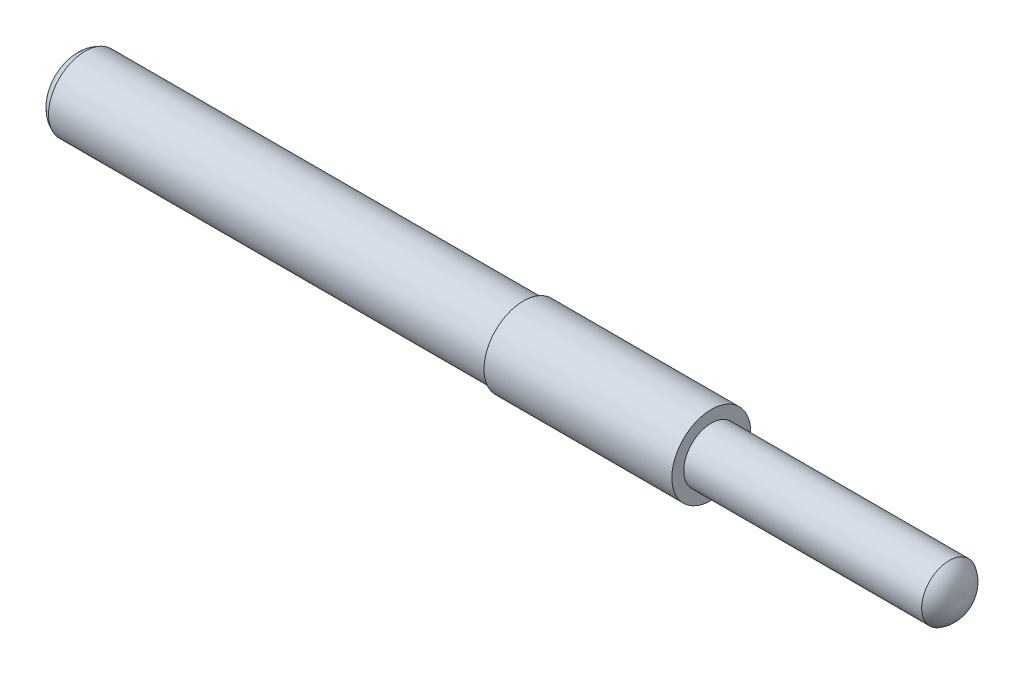
ISO-10303-21;
HEADER;
FILE_DESCRIPTION(('STEP AP214'),'2;1');
FILE_NAME('part.step','',(''),(''),'','','');
FILE_SCHEMA(('AUTOMOTIVE_DESIGN { 1 0 10303 214 1 1 1 1 }'));
ENDSEC;
DATA;
#1=APPLICATION_CONTEXT('core data for automotive mechanical design processes');
#2=APPLICATION_PROTOCOL_DEFINITION('international standard','automotive_design',2000,#1);
#3=PRODUCT_CONTEXT('',#1,'mechanical');
#4=PRODUCT('Part','Part','',(#3));
#5=PRODUCT_RELATED_PRODUCT_CATEGORY('part','',(#4));
#6=PRODUCT_DEFINITION_FORMATION('','',#4);
#7=PRODUCT_DEFINITION_CONTEXT('part definition',#1,'design');
#8=PRODUCT_DEFINITION('design','',#6,#7);
#9=PRODUCT_DEFINITION_SHAPE('','',#8);
#10=(LENGTH_UNIT() NAMED_UNIT(*) SI_UNIT(.MILLI.,.METRE.));
#11=(NAMED_UNIT(*) PLANE_ANGLE_UNIT() SI_UNIT($,.RADIAN.));
#12=(NAMED_UNIT(*) SI_UNIT($,.STERADIAN.) SOLID_ANGLE_UNIT());
#13=UNCERTAINTY_MEASURE_WITH_UNIT(LENGTH_MEASURE(1.E-05),#10,'distance_accuracy_value','');
#14=(GEOMETRIC_REPRESENTATION_CONTEXT(3) GLOBAL_UNCERTAINTY_ASSIGNED_CONTEXT((#13)) GLOBAL_UNIT_ASSIGNED_CONTEXT((#10,
#11,#12)) REPRESENTATION_CONTEXT('',''));
#15=CARTESIAN_POINT('',(0.,0.,0.));
#16=DIRECTION('',(0.,0.,1.));
#17=DIRECTION('',(1.,0.,0.));
#18=AXIS2_PLACEMENT_3D('',#15,#16,#17);
#19=CARTESIAN_POINT('',(-50.,0.,0.));
#20=DIRECTION('',(-1.,0.,0.));
#21=DIRECTION('',(0.,-1.,0.));
#22=AXIS2_PLACEMENT_3D('',#19,#20,#21);
#23=CYLINDRICAL_SURFACE('',#22,2.20000000000002);
#24=CARTESIAN_POINT('',(49.,0.,0.));
#25=DIRECTION('',(-1.,0.,0.));
#26=DIRECTION('',(0.,-1.,0.));
#27=AXIS2_PLACEMENT_3D('',#24,#25,#26);
#28=CIRCLE('',#27,2.20000000000002);
#29=CARTESIAN_POINT('',(49.,-2.2,0.));
#30=VERTEX_POINT('',#29);
#31=EDGE_CURVE('E11',#30,#30,#28,.T.);
#32=ORIENTED_EDGE('',*,*,#31,.T.);
#33=EDGE_LOOP('',(#32));
#34=FACE_BOUND('',#33,.T.);
#35=CARTESIAN_POINT('',(30.,0.,0.));
#36=DIRECTION('',(-1.,0.,0.));
#37=DIRECTION('',(0.,-1.,0.));
#38=AXIS2_PLACEMENT_3D('',#35,#36,#37);
#39=CIRCLE('',#38,2.20000000000002);
#40=CARTESIAN_POINT('',(30.,-2.2,0.));
#41=VERTEX_POINT('',#40);
#42=EDGE_CURVE('E71',#41,#41,#39,.T.);
#43=ORIENTED_EDGE('',*,*,#42,.F.);
#44=EDGE_LOOP('',(#43));
#45=FACE_BOUND('',#44,.T.);
#46=ADVANCED_FACE('F47',(#34,#45),#23,.T.);
#47=CARTESIAN_POINT('',(47.9718277716209,-0.405376259827689,0.));
#48=DIRECTION('',(0.,0.,-1.));
#49=DIRECTION('',(0.,-1.,0.));
#50=AXIS2_PLACEMENT_3D('',#47,#48,#49);
#51=CIRCLE('',#50,2.06828733497066);
#52=TRIMMED_CURVE('',#51,(PARAMETER_VALUE(-1.76806948002857)),
(PARAMETER_VALUE(1.76806948002857)),.T.,.PARAMETER.);
#53=CARTESIAN_POINT('',(47.9718277716209,0.,0.));
#54=DIRECTION('',(-1.,0.,0.));
#55=AXIS1_PLACEMENT('',#53,#54);
#56=SURFACE_OF_REVOLUTION('',#52,#55);
#57=CARTESIAN_POINT('',(50.,0.,0.));
#58=VERTEX_POINT('',#57);
#59=VERTEX_LOOP('',#58);
#60=FACE_BOUND('',#59,.T.);
#61=ORIENTED_EDGE('',*,*,#31,.F.);
#62=EDGE_LOOP('',(#61));
#63=FACE_BOUND('',#62,.T.);
#64=ADVANCED_FACE('F61',(#60,#63),#56,.T.);
#65=CARTESIAN_POINT('',(-19.4698172484888,-1.4625,0.));
#66=DIRECTION('',(0.,0.,-1.));
#67=DIRECTION('',(0.,-1.,0.));
#68=AXIS2_PLACEMENT_3D('',#65,#66,#67);
#69=CIRCLE('',#68,1.55563491861041);
#70=TRIMMED_CURVE('',#69,(PARAMETER_VALUE(-2.79380964974717)),
(PARAMETER_VALUE(2.79380964974717)),.T.,.PARAMETER.);
#71=CARTESIAN_POINT('',(-19.4698172484888,0.,0.));
#72=DIRECTION('',(-1.,0.,0.));
#73=AXIS1_PLACEMENT('',#71,#72);
#74=SURFACE_OF_REVOLUTION('',#70,#73);
#75=CARTESIAN_POINT('',(-20.,0.,0.));
#76=VERTEX_POINT('',#75);
#77=VERTEX_LOOP('',#76);
#78=FACE_BOUND('',#77,.T.);
#79=CARTESIAN_POINT('',(-20.,0.,0.));
#80=DIRECTION('',(-1.,0.,0.));
#81=DIRECTION('',(0.,-1.,0.));
#82=AXIS2_PLACEMENT_3D('',#79,#80,#81);
#83=CIRCLE('',#82,2.92500000000001);
#84=CARTESIAN_POINT('',(-20.,-2.925,0.));
#85=VERTEX_POINT('',#84);
#86=EDGE_CURVE('E55',#85,#85,#83,.T.);
#87=ORIENTED_EDGE('',*,*,#86,.T.);
#88=EDGE_LOOP('',(#87));
#89=FACE_BOUND('',#88,.T.);
#90=ADVANCED_FACE('F64',(#78,#89),#74,.T.);
#91=CARTESIAN_POINT('',(-50.,0.,0.));
#92=DIRECTION('',(-1.,0.,0.));
#93=DIRECTION('',(0.,-1.,0.));
#94=AXIS2_PLACEMENT_3D('',#91,#92,#93);
#95=CYLINDRICAL_SURFACE('',#94,2.92500000000001);
#96=ORIENTED_EDGE('',*,*,#86,.F.);
#97=EDGE_LOOP('',(#96));
#98=FACE_BOUND('',#97,.T.);
#99=CARTESIAN_POINT('',(15.,0.,0.));
#100=DIRECTION('',(-1.,0.,0.));
#101=DIRECTION('',(0.,-1.,0.));
#102=AXIS2_PLACEMENT_3D('',#99,#100,#101);
#103=CIRCLE('',#102,2.92500000000001);
#104=CARTESIAN_POINT('',(15.,-2.925,0.));
#105=VERTEX_POINT('',#104);
#106=EDGE_CURVE('E84',#105,#105,#103,.T.);
#107=ORIENTED_EDGE('',*,*,#106,.T.);
#108=EDGE_LOOP('',(#107));
#109=FACE_BOUND('',#108,.T.);
#110=ADVANCED_FACE('F92',(#98,#109),#95,.T.);
#111=CARTESIAN_POINT('',(15.,0.,0.));
#112=DIRECTION('',(1.,0.,0.));
#113=DIRECTION('',(0.,1.,0.));
#114=AXIS2_PLACEMENT_3D('',#111,#112,#113);
#115=PLANE('',#114);
#116=ORIENTED_EDGE('',*,*,#106,.F.);
#117=EDGE_LOOP('',(#116));
#118=FACE_BOUND('',#117,.T.);
#119=CARTESIAN_POINT('',(15.,0.,0.));
#120=DIRECTION('',(-1.,0.,0.));
#121=DIRECTION('',(0.,-1.,0.));
#122=AXIS2_PLACEMENT_3D('',#119,#120,#121);
#123=CIRCLE('',#122,3.15000000000001);
#124=CARTESIAN_POINT('',(15.,-3.15,0.));
#125=VERTEX_POINT('',#124);
#126=EDGE_CURVE('E78',#125,#125,#123,.T.);
#127=ORIENTED_EDGE('',*,*,#126,.T.);
#128=EDGE_LOOP('',(#127));
#129=FACE_BOUND('',#128,.T.);
#130=ADVANCED_FACE('F95',(#118,#129),#115,.F.);
#131=CARTESIAN_POINT('',(-50.,0.,0.));
#132=DIRECTION('',(-1.,0.,0.));
#133=DIRECTION('',(0.,-1.,0.));
#134=AXIS2_PLACEMENT_3D('',#131,#132,#133);
#135=CYLINDRICAL_SURFACE('',#134,3.15000000000001);
#136=ORIENTED_EDGE('',*,*,#126,.F.);
#137=EDGE_LOOP('',(#136));
#138=FACE_BOUND('',#137,.T.);
#139=CARTESIAN_POINT('',(30.,0.,0.));
#140=DIRECTION('',(-1.,0.,0.));
#141=DIRECTION('',(0.,-1.,0.));
#142=AXIS2_PLACEMENT_3D('',#139,#140,#141);
#143=CIRCLE('',#142,3.15000000000001);
#144=CARTESIAN_POINT('',(30.,-3.15,0.));
#145=VERTEX_POINT('',#144);
#146=EDGE_CURVE('E74',#145,#145,#143,.T.);
#147=ORIENTED_EDGE('',*,*,#146,.T.);
#148=EDGE_LOOP('',(#147));
#149=FACE_BOUND('',#148,.T.);
#150=ADVANCED_FACE('F101',(#138,#149),#135,.T.);
#151=CARTESIAN_POINT('',(30.,0.,0.));
#152=DIRECTION('',(-1.,0.,0.));
#153=DIRECTION('',(0.,-1.,0.));
#154=AXIS2_PLACEMENT_3D('',#151,#152,#153);
#155=PLANE('',#154);
#156=ORIENTED_EDGE('',*,*,#146,.F.);
#157=EDGE_LOOP('',(#156));
#158=FACE_BOUND('',#157,.T.);
#159=ORIENTED_EDGE('',*,*,#42,.T.);
#160=EDGE_LOOP('',(#159));
#161=FACE_BOUND('',#160,.T.);
#162=ADVANCED_FACE('F107',(#158,#161),#155,.F.);
#163=CLOSED_SHELL('',(#46,#64,#90,#110,#130,#150,#162));
#164=MANIFOLD_SOLID_BREP('B2',#163);
#165=ADVANCED_BREP_SHAPE_REPRESENTATION('',(#18,#164),#14);
#166=SHAPE_DEFINITION_REPRESENTATION(#9,#165);
ENDSEC;
END-ISO-10303-21;
